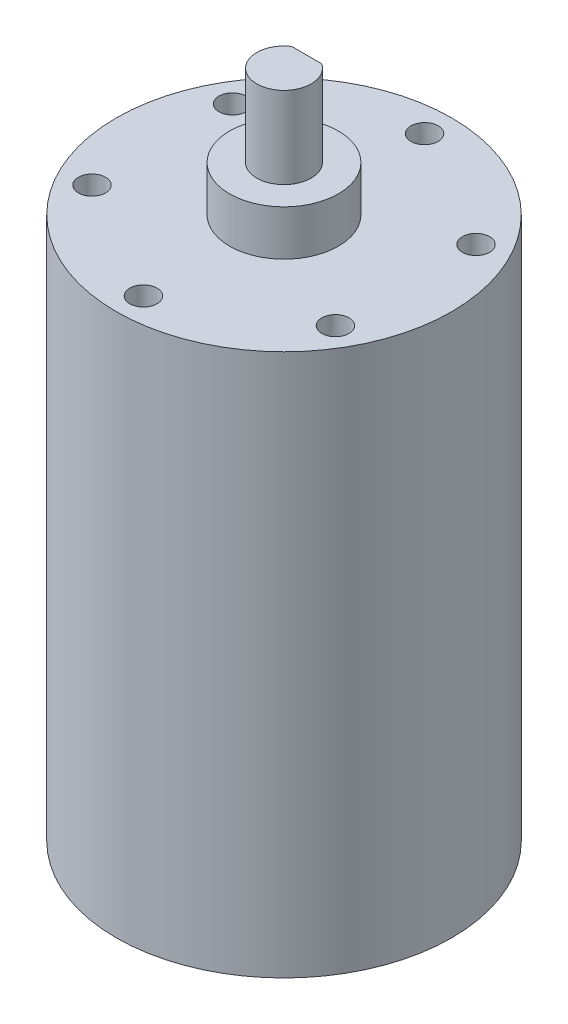
ISO-10303-21;
HEADER;
FILE_DESCRIPTION(('STEP AP214'),'2;1');
FILE_NAME('part.step','',(''),(''),'','','');
FILE_SCHEMA(('AUTOMOTIVE_DESIGN { 1 0 10303 214 1 1 1 1 }'));
ENDSEC;
DATA;
#1=APPLICATION_CONTEXT('core data for automotive mechanical design processes');
#2=APPLICATION_PROTOCOL_DEFINITION('international standard','automotive_design',2000,#1);
#3=PRODUCT_CONTEXT('',#1,'mechanical');
#4=PRODUCT('Part','Part','',(#3));
#5=PRODUCT_RELATED_PRODUCT_CATEGORY('part','',(#4));
#6=PRODUCT_DEFINITION_FORMATION('','',#4);
#7=PRODUCT_DEFINITION_CONTEXT('part definition',#1,'design');
#8=PRODUCT_DEFINITION('design','',#6,#7);
#9=PRODUCT_DEFINITION_SHAPE('','',#8);
#10=(LENGTH_UNIT() NAMED_UNIT(*) SI_UNIT(.MILLI.,.METRE.));
#11=(NAMED_UNIT(*) PLANE_ANGLE_UNIT() SI_UNIT($,.RADIAN.));
#12=(NAMED_UNIT(*) SI_UNIT($,.STERADIAN.) SOLID_ANGLE_UNIT());
#13=UNCERTAINTY_MEASURE_WITH_UNIT(LENGTH_MEASURE(1.E-05),#10,'distance_accuracy_value','');
#14=(GEOMETRIC_REPRESENTATION_CONTEXT(3) GLOBAL_UNCERTAINTY_ASSIGNED_CONTEXT((#13)) GLOBAL_UNIT_ASSIGNED_CONTEXT((#10,
#11,#12)) REPRESENTATION_CONTEXT('',''));
#15=CARTESIAN_POINT('',(0.,0.,0.));
#16=DIRECTION('',(0.,0.,1.));
#17=DIRECTION('',(1.,0.,0.));
#18=AXIS2_PLACEMENT_3D('',#15,#16,#17);
#19=CARTESIAN_POINT('',(0.,64.8,0.));
#20=DIRECTION('',(0.,1.,0.));
#21=DIRECTION('',(0.,0.,1.));
#22=AXIS2_PLACEMENT_3D('',#19,#20,#21);
#23=PLANE('',#22);
#24=CARTESIAN_POINT('',(0.,64.8,0.));
#25=DIRECTION('',(0.,1.,0.));
#26=DIRECTION('',(0.,0.,1.));
#27=AXIS2_PLACEMENT_3D('',#24,#25,#26);
#28=CIRCLE('',#27,6.);
#29=CARTESIAN_POINT('',(0.,64.8,6.));
#30=VERTEX_POINT('',#29);
#31=EDGE_CURVE('E70',#30,#30,#28,.T.);
#32=ORIENTED_EDGE('',*,*,#31,.T.);
#33=EDGE_LOOP('',(#32));
#34=FACE_BOUND('',#33,.T.);
#35=DIRECTION('',(-1.,0.,0.));
#36=VECTOR('',#35,1.);
#37=CARTESIAN_POINT('',(0.,64.8,-2.5));
#38=LINE('',#37,#36);
#39=CARTESIAN_POINT('',(1.6583123951777,64.8,-2.5));
#40=VERTEX_POINT('',#39);
#41=CARTESIAN_POINT('',(-1.6583123951777,64.8,-2.5));
#42=VERTEX_POINT('',#41);
#43=EDGE_CURVE('E11',#40,#42,#38,.T.);
#44=ORIENTED_EDGE('',*,*,#43,.F.);
#45=CARTESIAN_POINT('',(0.,64.8,0.));
#46=DIRECTION('',(0.,1.,0.));
#47=DIRECTION('',(0.,0.,1.));
#48=AXIS2_PLACEMENT_3D('',#45,#46,#47);
#49=CIRCLE('',#48,3.);
#50=EDGE_CURVE('E48',#40,#42,#49,.F.);
#51=ORIENTED_EDGE('',*,*,#50,.T.);
#52=EDGE_LOOP('',(#44,#51));
#53=FACE_BOUND('',#52,.T.);
#54=ADVANCED_FACE('F40',(#34,#53),#23,.T.);
#55=CARTESIAN_POINT('',(0.,59.8,0.));
#56=DIRECTION('',(0.,-1.,0.));
#57=DIRECTION('',(0.,0.,-1.));
#58=AXIS2_PLACEMENT_3D('',#55,#56,#57);
#59=CYLINDRICAL_SURFACE('',#58,18.5);
#60=CARTESIAN_POINT('',(0.,59.8,0.));
#61=DIRECTION('',(0.,1.,0.));
#62=DIRECTION('',(0.,0.,1.));
#63=AXIS2_PLACEMENT_3D('',#60,#61,#62);
#64=CIRCLE('',#63,18.5);
#65=CARTESIAN_POINT('',(0.,59.8,18.5));
#66=VERTEX_POINT('',#65);
#67=EDGE_CURVE('E92',#66,#66,#64,.T.);
#68=ORIENTED_EDGE('',*,*,#67,.F.);
#69=EDGE_LOOP('',(#68));
#70=FACE_BOUND('',#69,.T.);
#71=CARTESIAN_POINT('',(0.,0.,0.));
#72=DIRECTION('',(0.,1.,0.));
#73=DIRECTION('',(0.,0.,1.));
#74=AXIS2_PLACEMENT_3D('',#71,#72,#73);
#75=CIRCLE('',#74,18.5);
#76=CARTESIAN_POINT('',(0.,0.,18.5));
#77=VERTEX_POINT('',#76);
#78=EDGE_CURVE('E88',#77,#77,#75,.T.);
#79=ORIENTED_EDGE('',*,*,#78,.T.);
#80=EDGE_LOOP('',(#79));
#81=FACE_BOUND('',#80,.T.);
#82=ADVANCED_FACE('F42',(#70,#81),#59,.T.);
#83=CARTESIAN_POINT('',(0.,59.8,0.));
#84=DIRECTION('',(0.,1.,0.));
#85=DIRECTION('',(0.,0.,1.));
#86=AXIS2_PLACEMENT_3D('',#83,#84,#85);
#87=PLANE('',#86);
#88=CARTESIAN_POINT('',(-13.4233937586588,59.8,7.75000000000001));
#89=DIRECTION('',(0.,1.,0.));
#90=DIRECTION('',(0.,0.,1.));
#91=AXIS2_PLACEMENT_3D('',#88,#89,#90);
#92=CIRCLE('',#91,1.50000000000014);
#93=CARTESIAN_POINT('',(-13.4233937586588,59.8,9.25000000000015));
#94=VERTEX_POINT('',#93);
#95=EDGE_CURVE('E293',#94,#94,#92,.T.);
#96=ORIENTED_EDGE('',*,*,#95,.F.);
#97=EDGE_LOOP('',(#96));
#98=FACE_BOUND('',#97,.T.);
#99=CARTESIAN_POINT('',(0.,59.8,15.5));
#100=DIRECTION('',(0.,1.,0.));
#101=DIRECTION('',(0.,0.,1.));
#102=AXIS2_PLACEMENT_3D('',#99,#100,#101);
#103=CIRCLE('',#102,1.50000000000011);
#104=CARTESIAN_POINT('',(0.,59.8,17.0000000000001));
#105=VERTEX_POINT('',#104);
#106=EDGE_CURVE('E292',#105,#105,#103,.T.);
#107=ORIENTED_EDGE('',*,*,#106,.F.);
#108=EDGE_LOOP('',(#107));
#109=FACE_BOUND('',#108,.T.);
#110=CARTESIAN_POINT('',(13.4233937586588,59.8,7.75));
#111=DIRECTION('',(0.,1.,0.));
#112=DIRECTION('',(0.,0.,1.));
#113=AXIS2_PLACEMENT_3D('',#110,#111,#112);
#114=CIRCLE('',#113,1.50000000000007);
#115=CARTESIAN_POINT('',(13.4233937586588,59.8,9.25000000000007));
#116=VERTEX_POINT('',#115);
#117=EDGE_CURVE('E303',#116,#116,#114,.T.);
#118=ORIENTED_EDGE('',*,*,#117,.F.);
#119=EDGE_LOOP('',(#118));
#120=FACE_BOUND('',#119,.T.);
#121=CARTESIAN_POINT('',(13.4233937586588,59.8,-7.75000000000001));
#122=DIRECTION('',(0.,1.,0.));
#123=DIRECTION('',(0.,0.,1.));
#124=AXIS2_PLACEMENT_3D('',#121,#122,#123);
#125=CIRCLE('',#124,1.50000000000004);
#126=CARTESIAN_POINT('',(13.4233937586588,59.8,-6.24999999999997));
#127=VERTEX_POINT('',#126);
#128=EDGE_CURVE('E309',#127,#127,#125,.T.);
#129=ORIENTED_EDGE('',*,*,#128,.F.);
#130=EDGE_LOOP('',(#129));
#131=FACE_BOUND('',#130,.T.);
#132=CARTESIAN_POINT('',(0.,59.8,-15.5));
#133=DIRECTION('',(0.,1.,0.));
#134=DIRECTION('',(0.,0.,1.));
#135=AXIS2_PLACEMENT_3D('',#132,#133,#134);
#136=CIRCLE('',#135,1.5);
#137=CARTESIAN_POINT('',(0.,59.8,-14.));
#138=VERTEX_POINT('',#137);
#139=EDGE_CURVE('E315',#138,#138,#136,.T.);
#140=ORIENTED_EDGE('',*,*,#139,.F.);
#141=EDGE_LOOP('',(#140));
#142=FACE_BOUND('',#141,.T.);
#143=CARTESIAN_POINT('',(-13.4233937586588,59.8,-7.74999999999999));
#144=DIRECTION('',(0.,1.,0.));
#145=DIRECTION('',(0.,0.,1.));
#146=AXIS2_PLACEMENT_3D('',#143,#144,#145);
#147=CIRCLE('',#146,1.50000000000018);
#148=CARTESIAN_POINT('',(-13.4233937586588,59.8,-6.24999999999981));
#149=VERTEX_POINT('',#148);
#150=EDGE_CURVE('E81',#149,#149,#147,.T.);
#151=ORIENTED_EDGE('',*,*,#150,.F.);
#152=EDGE_LOOP('',(#151));
#153=FACE_BOUND('',#152,.T.);
#154=CARTESIAN_POINT('',(0.,59.8,0.));
#155=DIRECTION('',(0.,1.,0.));
#156=DIRECTION('',(0.,0.,1.));
#157=AXIS2_PLACEMENT_3D('',#154,#155,#156);
#158=CIRCLE('',#157,6.);
#159=CARTESIAN_POINT('',(0.,59.8,6.));
#160=VERTEX_POINT('',#159);
#161=EDGE_CURVE('E89',#160,#160,#158,.T.);
#162=ORIENTED_EDGE('',*,*,#161,.F.);
#163=EDGE_LOOP('',(#162));
#164=FACE_BOUND('',#163,.T.);
#165=ORIENTED_EDGE('',*,*,#67,.T.);
#166=EDGE_LOOP('',(#165));
#167=FACE_BOUND('',#166,.T.);
#168=ADVANCED_FACE('F103',(#98,#109,#120,#131,#142,#153,#164,#167),#87,.T.);
#169=CARTESIAN_POINT('',(0.,0.,0.));
#170=DIRECTION('',(0.,1.,0.));
#171=DIRECTION('',(0.,0.,1.));
#172=AXIS2_PLACEMENT_3D('',#169,#170,#171);
#173=PLANE('',#172);
#174=ORIENTED_EDGE('',*,*,#78,.F.);
#175=EDGE_LOOP('',(#174));
#176=FACE_BOUND('',#175,.T.);
#177=ADVANCED_FACE('F111',(#176),#173,.F.);
#178=CARTESIAN_POINT('',(0.,64.8,0.));
#179=DIRECTION('',(0.,-1.,0.));
#180=DIRECTION('',(0.,0.,-1.));
#181=AXIS2_PLACEMENT_3D('',#178,#179,#180);
#182=CYLINDRICAL_SURFACE('',#181,6.);
#183=ORIENTED_EDGE('',*,*,#31,.F.);
#184=EDGE_LOOP('',(#183));
#185=FACE_BOUND('',#184,.T.);
#186=ORIENTED_EDGE('',*,*,#161,.T.);
#187=EDGE_LOOP('',(#186));
#188=FACE_BOUND('',#187,.T.);
#189=ADVANCED_FACE('F108',(#185,#188),#182,.T.);
#190=CARTESIAN_POINT('',(0.,73.8,-2.5));
#191=DIRECTION('',(0.,0.,-1.));
#192=DIRECTION('',(-1.,0.,0.));
#193=AXIS2_PLACEMENT_3D('',#190,#191,#192);
#194=PLANE('',#193);
#195=DIRECTION('',(0.,-1.,0.));
#196=VECTOR('',#195,1.);
#197=CARTESIAN_POINT('',(1.6583123951777,73.8,-2.5));
#198=LINE('',#197,#196);
#199=CARTESIAN_POINT('',(1.6583123951777,73.8,-2.5));
#200=VERTEX_POINT('',#199);
#201=EDGE_CURVE('E71',#200,#40,#198,.T.);
#202=ORIENTED_EDGE('',*,*,#201,.T.);
#203=ORIENTED_EDGE('',*,*,#43,.T.);
#204=DIRECTION('',(0.,-1.,0.));
#205=VECTOR('',#204,1.);
#206=CARTESIAN_POINT('',(-1.6583123951777,73.8,-2.5));
#207=LINE('',#206,#205);
#208=CARTESIAN_POINT('',(-1.6583123951777,73.8,-2.5));
#209=VERTEX_POINT('',#208);
#210=EDGE_CURVE('E55',#209,#42,#207,.T.);
#211=ORIENTED_EDGE('',*,*,#210,.F.);
#212=DIRECTION('',(1.,0.,0.));
#213=VECTOR('',#212,1.);
#214=CARTESIAN_POINT('',(0.,73.8,-2.5));
#215=LINE('',#214,#213);
#216=EDGE_CURVE('E68',#209,#200,#215,.T.);
#217=ORIENTED_EDGE('',*,*,#216,.T.);
#218=EDGE_LOOP('',(#202,#203,#211,#217));
#219=FACE_BOUND('',#218,.T.);
#220=ADVANCED_FACE('F66',(#219),#194,.T.);
#221=CARTESIAN_POINT('',(0.,73.8,0.));
#222=DIRECTION('',(0.,-1.,0.));
#223=DIRECTION('',(0.,0.,-1.));
#224=AXIS2_PLACEMENT_3D('',#221,#222,#223);
#225=CYLINDRICAL_SURFACE('',#224,3.);
#226=ORIENTED_EDGE('',*,*,#50,.F.);
#227=ORIENTED_EDGE('',*,*,#201,.F.);
#228=CARTESIAN_POINT('',(0.,73.8,0.));
#229=DIRECTION('',(0.,1.,0.));
#230=DIRECTION('',(0.,0.,1.));
#231=AXIS2_PLACEMENT_3D('',#228,#229,#230);
#232=CIRCLE('',#231,3.);
#233=EDGE_CURVE('E73',#209,#200,#232,.T.);
#234=ORIENTED_EDGE('',*,*,#233,.F.);
#235=ORIENTED_EDGE('',*,*,#210,.T.);
#236=EDGE_LOOP('',(#226,#227,#234,#235));
#237=FACE_BOUND('',#236,.T.);
#238=ADVANCED_FACE('F74',(#237),#225,.T.);
#239=CARTESIAN_POINT('',(0.,73.8,0.));
#240=DIRECTION('',(0.,1.,0.));
#241=DIRECTION('',(0.,0.,1.));
#242=AXIS2_PLACEMENT_3D('',#239,#240,#241);
#243=PLANE('',#242);
#244=ORIENTED_EDGE('',*,*,#216,.F.);
#245=ORIENTED_EDGE('',*,*,#233,.T.);
#246=EDGE_LOOP('',(#244,#245));
#247=FACE_BOUND('',#246,.T.);
#248=ADVANCED_FACE('F77',(#247),#243,.T.);
#249=CARTESIAN_POINT('',(-13.4233937586588,54.8,-7.74999999999999));
#250=DIRECTION('',(0.,1.,0.));
#251=DIRECTION('',(0.,0.,1.));
#252=AXIS2_PLACEMENT_3D('',#249,#250,#251);
#253=CYLINDRICAL_SURFACE('',#252,1.50000000000018);
#254=CARTESIAN_POINT('',(-13.4233937586588,54.8,-7.74999999999999));
#255=DIRECTION('',(0.,1.,0.));
#256=DIRECTION('',(0.,0.,1.));
#257=AXIS2_PLACEMENT_3D('',#254,#255,#256);
#258=CIRCLE('',#257,1.50000000000018);
#259=CARTESIAN_POINT('',(-13.4233937586588,54.8,-6.24999999999981));
#260=VERTEX_POINT('',#259);
#261=EDGE_CURVE('E78',#260,#260,#258,.T.);
#262=ORIENTED_EDGE('',*,*,#261,.F.);
#263=EDGE_LOOP('',(#262));
#264=FACE_BOUND('',#263,.T.);
#265=ORIENTED_EDGE('',*,*,#150,.T.);
#266=EDGE_LOOP('',(#265));
#267=FACE_BOUND('',#266,.T.);
#268=ADVANCED_FACE('F144',(#264,#267),#253,.F.);
#269=CARTESIAN_POINT('',(0.,54.8,0.));
#270=DIRECTION('',(0.,1.,0.));
#271=DIRECTION('',(0.,0.,1.));
#272=AXIS2_PLACEMENT_3D('',#269,#270,#271);
#273=PLANE('',#272);
#274=ORIENTED_EDGE('',*,*,#261,.T.);
#275=EDGE_LOOP('',(#274));
#276=FACE_BOUND('',#275,.T.);
#277=ADVANCED_FACE('F151',(#276),#273,.T.);
#278=CARTESIAN_POINT('',(0.,54.8,-15.5));
#279=DIRECTION('',(0.,1.,0.));
#280=DIRECTION('',(0.,0.,1.));
#281=AXIS2_PLACEMENT_3D('',#278,#279,#280);
#282=CYLINDRICAL_SURFACE('',#281,1.5);
#283=CARTESIAN_POINT('',(0.,54.8,-15.5));
#284=DIRECTION('',(0.,1.,0.));
#285=DIRECTION('',(0.,0.,1.));
#286=AXIS2_PLACEMENT_3D('',#283,#284,#285);
#287=CIRCLE('',#286,1.5);
#288=CARTESIAN_POINT('',(0.,54.8,-14.));
#289=VERTEX_POINT('',#288);
#290=EDGE_CURVE('E318',#289,#289,#287,.T.);
#291=ORIENTED_EDGE('',*,*,#290,.F.);
#292=EDGE_LOOP('',(#291));
#293=FACE_BOUND('',#292,.T.);
#294=ORIENTED_EDGE('',*,*,#139,.T.);
#295=EDGE_LOOP('',(#294));
#296=FACE_BOUND('',#295,.T.);
#297=ADVANCED_FACE('F159',(#293,#296),#282,.F.);
#298=CARTESIAN_POINT('',(0.,54.8,0.));
#299=DIRECTION('',(0.,1.,0.));
#300=DIRECTION('',(0.,0.,1.));
#301=AXIS2_PLACEMENT_3D('',#298,#299,#300);
#302=PLANE('',#301);
#303=ORIENTED_EDGE('',*,*,#290,.T.);
#304=EDGE_LOOP('',(#303));
#305=FACE_BOUND('',#304,.T.);
#306=ADVANCED_FACE('F167',(#305),#302,.T.);
#307=CARTESIAN_POINT('',(13.4233937586588,54.8,-7.75000000000001));
#308=DIRECTION('',(0.,1.,0.));
#309=DIRECTION('',(0.,0.,1.));
#310=AXIS2_PLACEMENT_3D('',#307,#308,#309);
#311=CYLINDRICAL_SURFACE('',#310,1.50000000000004);
#312=CARTESIAN_POINT('',(13.4233937586588,54.8,-7.75000000000001));
#313=DIRECTION('',(0.,1.,0.));
#314=DIRECTION('',(0.,0.,1.));
#315=AXIS2_PLACEMENT_3D('',#312,#313,#314);
#316=CIRCLE('',#315,1.50000000000004);
#317=CARTESIAN_POINT('',(13.4233937586588,54.8,-6.24999999999997));
#318=VERTEX_POINT('',#317);
#319=EDGE_CURVE('E312',#318,#318,#316,.T.);
#320=ORIENTED_EDGE('',*,*,#319,.F.);
#321=EDGE_LOOP('',(#320));
#322=FACE_BOUND('',#321,.T.);
#323=ORIENTED_EDGE('',*,*,#128,.T.);
#324=EDGE_LOOP('',(#323));
#325=FACE_BOUND('',#324,.T.);
#326=ADVANCED_FACE('F175',(#322,#325),#311,.F.);
#327=CARTESIAN_POINT('',(0.,54.8,0.));
#328=DIRECTION('',(0.,1.,0.));
#329=DIRECTION('',(0.,0.,1.));
#330=AXIS2_PLACEMENT_3D('',#327,#328,#329);
#331=PLANE('',#330);
#332=ORIENTED_EDGE('',*,*,#319,.T.);
#333=EDGE_LOOP('',(#332));
#334=FACE_BOUND('',#333,.T.);
#335=ADVANCED_FACE('F183',(#334),#331,.T.);
#336=CARTESIAN_POINT('',(13.4233937586588,54.8,7.75));
#337=DIRECTION('',(0.,1.,0.));
#338=DIRECTION('',(0.,0.,1.));
#339=AXIS2_PLACEMENT_3D('',#336,#337,#338);
#340=CYLINDRICAL_SURFACE('',#339,1.50000000000007);
#341=CARTESIAN_POINT('',(13.4233937586588,54.8,7.75));
#342=DIRECTION('',(0.,1.,0.));
#343=DIRECTION('',(0.,0.,1.));
#344=AXIS2_PLACEMENT_3D('',#341,#342,#343);
#345=CIRCLE('',#344,1.50000000000007);
#346=CARTESIAN_POINT('',(13.4233937586588,54.8,9.25000000000007));
#347=VERTEX_POINT('',#346);
#348=EDGE_CURVE('E306',#347,#347,#345,.T.);
#349=ORIENTED_EDGE('',*,*,#348,.F.);
#350=EDGE_LOOP('',(#349));
#351=FACE_BOUND('',#350,.T.);
#352=ORIENTED_EDGE('',*,*,#117,.T.);
#353=EDGE_LOOP('',(#352));
#354=FACE_BOUND('',#353,.T.);
#355=ADVANCED_FACE('F191',(#351,#354),#340,.F.);
#356=CARTESIAN_POINT('',(0.,54.8,0.));
#357=DIRECTION('',(0.,1.,0.));
#358=DIRECTION('',(0.,0.,1.));
#359=AXIS2_PLACEMENT_3D('',#356,#357,#358);
#360=PLANE('',#359);
#361=ORIENTED_EDGE('',*,*,#348,.T.);
#362=EDGE_LOOP('',(#361));
#363=FACE_BOUND('',#362,.T.);
#364=ADVANCED_FACE('F199',(#363),#360,.T.);
#365=CARTESIAN_POINT('',(0.,54.8,15.5));
#366=DIRECTION('',(0.,1.,0.));
#367=DIRECTION('',(0.,0.,1.));
#368=AXIS2_PLACEMENT_3D('',#365,#366,#367);
#369=CYLINDRICAL_SURFACE('',#368,1.50000000000011);
#370=CARTESIAN_POINT('',(0.,54.8,15.5));
#371=DIRECTION('',(0.,1.,0.));
#372=DIRECTION('',(0.,0.,1.));
#373=AXIS2_PLACEMENT_3D('',#370,#371,#372);
#374=CIRCLE('',#373,1.50000000000011);
#375=CARTESIAN_POINT('',(0.,54.8,17.0000000000001));
#376=VERTEX_POINT('',#375);
#377=EDGE_CURVE('E296',#376,#376,#374,.T.);
#378=ORIENTED_EDGE('',*,*,#377,.F.);
#379=EDGE_LOOP('',(#378));
#380=FACE_BOUND('',#379,.T.);
#381=ORIENTED_EDGE('',*,*,#106,.T.);
#382=EDGE_LOOP('',(#381));
#383=FACE_BOUND('',#382,.T.);
#384=ADVANCED_FACE('F207',(#380,#383),#369,.F.);
#385=CARTESIAN_POINT('',(0.,54.8,0.));
#386=DIRECTION('',(0.,1.,0.));
#387=DIRECTION('',(0.,0.,1.));
#388=AXIS2_PLACEMENT_3D('',#385,#386,#387);
#389=PLANE('',#388);
#390=ORIENTED_EDGE('',*,*,#377,.T.);
#391=EDGE_LOOP('',(#390));
#392=FACE_BOUND('',#391,.T.);
#393=ADVANCED_FACE('F215',(#392),#389,.T.);
#394=CARTESIAN_POINT('',(-13.4233937586588,54.8,7.75000000000001));
#395=DIRECTION('',(0.,1.,0.));
#396=DIRECTION('',(0.,0.,1.));
#397=AXIS2_PLACEMENT_3D('',#394,#395,#396);
#398=CYLINDRICAL_SURFACE('',#397,1.50000000000014);
#399=CARTESIAN_POINT('',(-13.4233937586588,54.8,7.75000000000001));
#400=DIRECTION('',(0.,1.,0.));
#401=DIRECTION('',(0.,0.,1.));
#402=AXIS2_PLACEMENT_3D('',#399,#400,#401);
#403=CIRCLE('',#402,1.50000000000014);
#404=CARTESIAN_POINT('',(-13.4233937586588,54.8,9.25000000000015));
#405=VERTEX_POINT('',#404);
#406=EDGE_CURVE('E291',#405,#405,#403,.T.);
#407=ORIENTED_EDGE('',*,*,#406,.F.);
#408=EDGE_LOOP('',(#407));
#409=FACE_BOUND('',#408,.T.);
#410=ORIENTED_EDGE('',*,*,#95,.T.);
#411=EDGE_LOOP('',(#410));
#412=FACE_BOUND('',#411,.T.);
#413=ADVANCED_FACE('F223',(#409,#412),#398,.F.);
#414=CARTESIAN_POINT('',(0.,54.8,0.));
#415=DIRECTION('',(0.,1.,0.));
#416=DIRECTION('',(0.,0.,1.));
#417=AXIS2_PLACEMENT_3D('',#414,#415,#416);
#418=PLANE('',#417);
#419=ORIENTED_EDGE('',*,*,#406,.T.);
#420=EDGE_LOOP('',(#419));
#421=FACE_BOUND('',#420,.T.);
#422=ADVANCED_FACE('F231',(#421),#418,.T.);
#423=CLOSED_SHELL('',(#54,#82,#168,#177,#189,#220,#238,#248,#268,#277,#297,#306,#326,#335,#355,
#364,#384,#393,#413,#422));
#424=MANIFOLD_SOLID_BREP('B2',#423);
#425=ADVANCED_BREP_SHAPE_REPRESENTATION('',(#18,#424),#14);
#426=SHAPE_DEFINITION_REPRESENTATION(#9,#425);
ENDSEC;
END-ISO-10303-21;
